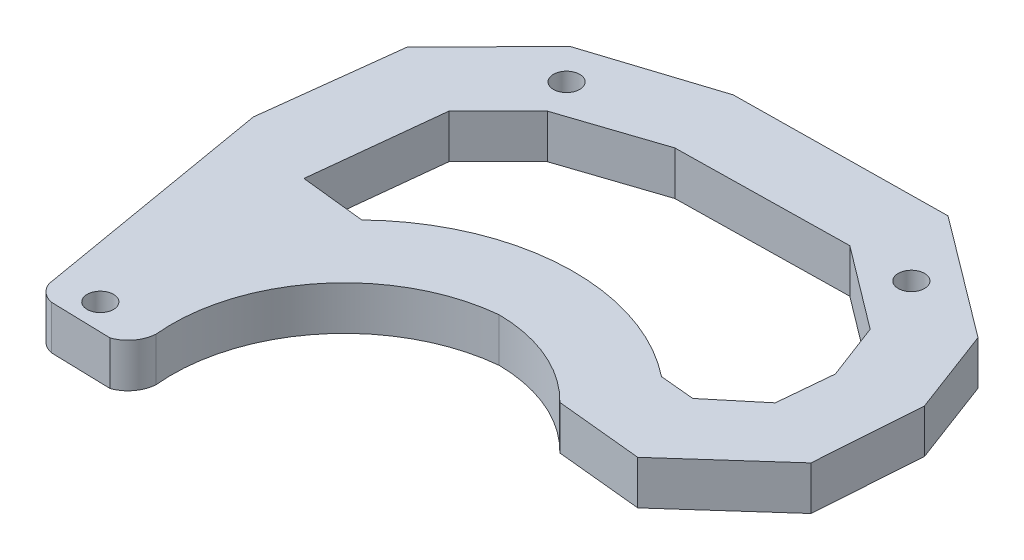
ISO-10303-21;
HEADER;
FILE_DESCRIPTION(('STEP AP214'),'2;1');
FILE_NAME('part.step','',(''),(''),'','','');
FILE_SCHEMA(('AUTOMOTIVE_DESIGN { 1 0 10303 214 1 1 1 1 }'));
ENDSEC;
DATA;
#1=APPLICATION_CONTEXT('core data for automotive mechanical design processes');
#2=APPLICATION_PROTOCOL_DEFINITION('international standard','automotive_design',2000,#1);
#3=PRODUCT_CONTEXT('',#1,'mechanical');
#4=PRODUCT('Part','Part','',(#3));
#5=PRODUCT_RELATED_PRODUCT_CATEGORY('part','',(#4));
#6=PRODUCT_DEFINITION_FORMATION('','',#4);
#7=PRODUCT_DEFINITION_CONTEXT('part definition',#1,'design');
#8=PRODUCT_DEFINITION('design','',#6,#7);
#9=PRODUCT_DEFINITION_SHAPE('','',#8);
#10=(LENGTH_UNIT() NAMED_UNIT(*) SI_UNIT(.MILLI.,.METRE.));
#11=(NAMED_UNIT(*) PLANE_ANGLE_UNIT() SI_UNIT($,.RADIAN.));
#12=(NAMED_UNIT(*) SI_UNIT($,.STERADIAN.) SOLID_ANGLE_UNIT());
#13=UNCERTAINTY_MEASURE_WITH_UNIT(LENGTH_MEASURE(1.E-05),#10,'distance_accuracy_value','');
#14=(GEOMETRIC_REPRESENTATION_CONTEXT(3) GLOBAL_UNCERTAINTY_ASSIGNED_CONTEXT((#13)) GLOBAL_UNIT_ASSIGNED_CONTEXT((#10,
#11,#12)) REPRESENTATION_CONTEXT('',''));
#15=CARTESIAN_POINT('',(0.,0.,0.));
#16=DIRECTION('',(0.,0.,1.));
#17=DIRECTION('',(1.,0.,0.));
#18=AXIS2_PLACEMENT_3D('',#15,#16,#17);
#19=CARTESIAN_POINT('',(23.8619489201939,5.,-4.36412708206895));
#20=DIRECTION('',(0.,-1.,0.));
#21=DIRECTION('',(0.,0.,-1.));
#22=AXIS2_PLACEMENT_3D('',#19,#20,#21);
#23=PLANE('',#22);
#24=CARTESIAN_POINT('',(0.,5.,0.));
#25=DIRECTION('',(0.,1.,0.));
#26=DIRECTION('',(0.,0.,1.));
#27=AXIS2_PLACEMENT_3D('',#24,#25,#26);
#28=CIRCLE('',#27,1.5);
#29=CARTESIAN_POINT('',(0.,5.,1.5));
#30=VERTEX_POINT('',#29);
#31=EDGE_CURVE('E489',#30,#30,#28,.T.);
#32=ORIENTED_EDGE('',*,*,#31,.F.);
#33=EDGE_LOOP('',(#32));
#34=FACE_BOUND('',#33,.T.);
#35=CARTESIAN_POINT('',(44.1944725973829,5.,-48.3351235325393));
#36=DIRECTION('',(0.,1.,0.));
#37=DIRECTION('',(0.,0.,1.));
#38=AXIS2_PLACEMENT_3D('',#35,#36,#37);
#39=CIRCLE('',#38,1.5);
#40=CARTESIAN_POINT('',(44.1944725973829,5.,-46.8351235325393));
#41=VERTEX_POINT('',#40);
#42=EDGE_CURVE('E935',#41,#41,#39,.T.);
#43=ORIENTED_EDGE('',*,*,#42,.F.);
#44=EDGE_LOOP('',(#43));
#45=FACE_BOUND('',#44,.T.);
#46=CARTESIAN_POINT('',(4.85938662458676,5.,-48.3351235325393));
#47=DIRECTION('',(0.,1.,0.));
#48=DIRECTION('',(0.,0.,1.));
#49=AXIS2_PLACEMENT_3D('',#46,#47,#48);
#50=CIRCLE('',#49,1.5);
#51=CARTESIAN_POINT('',(4.85938662458676,5.,-46.8351235325393));
#52=VERTEX_POINT('',#51);
#53=EDGE_CURVE('E937',#52,#52,#50,.T.);
#54=ORIENTED_EDGE('',*,*,#53,.F.);
#55=EDGE_LOOP('',(#54));
#56=FACE_BOUND('',#55,.T.);
#57=CARTESIAN_POINT('',(23.8619489201939,5.,-4.36412708206895));
#58=DIRECTION('',(0.,-1.,0.));
#59=DIRECTION('',(0.,0.,-1.));
#60=AXIS2_PLACEMENT_3D('',#57,#58,#59);
#61=CIRCLE('',#60,17.1176645684823);
#62=CARTESIAN_POINT('',(24.0303696505869,5.,-21.4809630845738));
#63=VERTEX_POINT('',#62);
#64=CARTESIAN_POINT('',(36.1485437948303,5.,-16.282769062833));
#65=VERTEX_POINT('',#64);
#66=EDGE_CURVE('E339',#63,#65,#61,.T.);
#67=ORIENTED_EDGE('',*,*,#66,.T.);
#68=DIRECTION('',(0.995092776882781,0.,0.0989462752998577));
#69=VECTOR('',#68,1.);
#70=CARTESIAN_POINT('',(36.1485437948303,5.,-16.282769062833));
#71=LINE('',#70,#69);
#72=CARTESIAN_POINT('',(46.0125685543336,5.,-15.3019474428874));
#73=VERTEX_POINT('',#72);
#74=EDGE_CURVE('E343',#65,#73,#71,.T.);
#75=ORIENTED_EDGE('',*,*,#74,.T.);
#76=DIRECTION('',(0.745619037206649,0.,-0.666372456930079));
#77=VECTOR('',#76,1.);
#78=CARTESIAN_POINT('',(46.0125685543336,5.,-15.3019474428874));
#79=LINE('',#78,#77);
#80=CARTESIAN_POINT('',(56.4485439017676,5.,-24.6287566922655));
#81=VERTEX_POINT('',#80);
#82=EDGE_CURVE('E347',#73,#81,#79,.T.);
#83=ORIENTED_EDGE('',*,*,#82,.T.);
#84=DIRECTION('',(0.0694048542160812,0.,-0.997588575621857));
#85=VECTOR('',#84,1.);
#86=CARTESIAN_POINT('',(56.4485439017676,5.,-24.6287566922655));
#87=LINE('',#86,#85);
#88=CARTESIAN_POINT('',(57.2910563095753,5.,-36.7385833368377));
#89=VERTEX_POINT('',#88);
#90=EDGE_CURVE('E350',#81,#89,#87,.T.);
#91=ORIENTED_EDGE('',*,*,#90,.T.);
#92=DIRECTION('',(-0.352627894261719,0.,-0.935763628374466));
#93=VECTOR('',#92,1.);
#94=CARTESIAN_POINT('',(53.5993779387816,5.,-46.5351377310327));
#95=LINE('',#94,#93);
#96=CARTESIAN_POINT('',(53.5993779387816,5.,-46.5351377310327));
#97=VERTEX_POINT('',#96);
#98=EDGE_CURVE('E353',#89,#97,#95,.T.);
#99=ORIENTED_EDGE('',*,*,#98,.T.);
#100=DIRECTION('',(-0.799549081819372,0.,-0.600600754046978));
#101=VECTOR('',#100,1.);
#102=CARTESIAN_POINT('',(39.8562210186548,5.,-56.8586445636987));
#103=LINE('',#102,#101);
#104=CARTESIAN_POINT('',(39.8562210186548,5.,-56.8586445636987));
#105=VERTEX_POINT('',#104);
#106=EDGE_CURVE('E356',#97,#105,#103,.T.);
#107=ORIENTED_EDGE('',*,*,#106,.T.);
#108=DIRECTION('',(-0.999923776978017,0.,0.0123466689441868));
#109=VECTOR('',#108,1.);
#110=CARTESIAN_POINT('',(15.6513017988494,5.,-56.5597716582749));
#111=LINE('',#110,#109);
#112=CARTESIAN_POINT('',(15.6513017988494,5.,-56.5597716582749));
#113=VERTEX_POINT('',#112);
#114=EDGE_CURVE('E359',#105,#113,#111,.T.);
#115=ORIENTED_EDGE('',*,*,#114,.T.);
#116=DIRECTION('',(-0.952162057756407,0.,0.305593546674476));
#117=VECTOR('',#116,1.);
#118=CARTESIAN_POINT('',(1.56972804240098,5.,-52.0403329430513));
#119=LINE('',#118,#117);
#120=CARTESIAN_POINT('',(1.56972804240098,5.,-52.0403329430513));
#121=VERTEX_POINT('',#120);
#122=EDGE_CURVE('E362',#113,#121,#119,.T.);
#123=ORIENTED_EDGE('',*,*,#122,.T.);
#124=DIRECTION('',(-0.702611164135424,0.,0.711573996174863));
#125=VECTOR('',#124,1.);
#126=CARTESIAN_POINT('',(-7.66832590474408,5.,-42.6844341193572));
#127=LINE('',#126,#125);
#128=CARTESIAN_POINT('',(-7.66832590474408,5.,-42.6844341193572));
#129=VERTEX_POINT('',#128);
#130=EDGE_CURVE('E365',#121,#129,#127,.T.);
#131=ORIENTED_EDGE('',*,*,#130,.T.);
#132=DIRECTION('',(-0.118846884238914,0.,0.992912593387103));
#133=VECTOR('',#132,1.);
#134=CARTESIAN_POINT('',(-9.54463394847041,5.,-27.0087191216949));
#135=LINE('',#134,#133);
#136=CARTESIAN_POINT('',(-9.54463394847041,5.,-27.0087191216949));
#137=VERTEX_POINT('',#136);
#138=EDGE_CURVE('E368',#129,#137,#135,.T.);
#139=ORIENTED_EDGE('',*,*,#138,.T.);
#140=DIRECTION('',(0.168776467263028,0.,0.985654353258896));
#141=VECTOR('',#140,1.);
#142=CARTESIAN_POINT('',(-9.54463394847041,5.,-27.0087191216949));
#143=LINE('',#142,#141);
#144=CARTESIAN_POINT('',(-4.73336120879583,5.,1.08910753316435));
#145=VERTEX_POINT('',#144);
#146=EDGE_CURVE('E371',#137,#145,#143,.T.);
#147=ORIENTED_EDGE('',*,*,#146,.T.);
#148=CARTESIAN_POINT('',(-2.2064226973066,5.,0.202619342875816));
#149=DIRECTION('',(0.,1.,0.));
#150=DIRECTION('',(0.,0.,1.));
#151=AXIS2_PLACEMENT_3D('',#148,#149,#150);
#152=CIRCLE('',#151,2.67792448593467);
#153=CARTESIAN_POINT('',(-2.77137388857478,5.,2.82027281571234));
#154=VERTEX_POINT('',#153);
#155=EDGE_CURVE('E374',#145,#154,#152,.T.);
#156=ORIENTED_EDGE('',*,*,#155,.T.);
#157=DIRECTION('',(0.999639850526293,0.,0.0268359691416453));
#158=VECTOR('',#157,1.);
#159=CARTESIAN_POINT('',(-2.77137388857478,5.,2.82027281571234));
#160=LINE('',#159,#158);
#161=CARTESIAN_POINT('',(4.10712283408258,5.,3.0049304458508));
#162=VERTEX_POINT('',#161);
#163=EDGE_CURVE('E377',#154,#162,#160,.T.);
#164=ORIENTED_EDGE('',*,*,#163,.T.);
#165=CARTESIAN_POINT('',(2.97809004025998,5.,-0.193420609139489));
#166=DIRECTION('',(0.,1.,0.));
#167=DIRECTION('',(0.,0.,1.));
#168=AXIS2_PLACEMENT_3D('',#165,#166,#167);
#169=CIRCLE('',#168,3.39177896102979);
#170=CARTESIAN_POINT('',(6.36434947929362,5.,0.));
#171=VERTEX_POINT('',#170);
#172=EDGE_CURVE('E380',#162,#171,#169,.T.);
#173=ORIENTED_EDGE('',*,*,#172,.T.);
#174=CARTESIAN_POINT('',(25.9378411072272,5.,-1.90747145664024));
#175=DIRECTION('',(0.,-1.,0.));
#176=DIRECTION('',(0.,0.,-1.));
#177=AXIS2_PLACEMENT_3D('',#174,#175,#176);
#178=CIRCLE('',#177,19.6662152400172);
#179=EDGE_CURVE('E383',#171,#63,#178,.T.);
#180=ORIENTED_EDGE('',*,*,#179,.T.);
#181=EDGE_LOOP('',(#67,#75,#83,#91,#99,#107,#115,#123,#131,#139,#147,#156,#164,#173,#180));
#182=FACE_BOUND('',#181,.T.);
#183=DIRECTION('',(-0.707106781186546,0.,0.707106781186549));
#184=VECTOR('',#183,1.);
#185=CARTESIAN_POINT('',(1.03693216322498,5.,-38.7436949319863));
#186=LINE('',#185,#184);
#187=CARTESIAN_POINT('',(6.64236036606208,5.,-44.3491231348234));
#188=VERTEX_POINT('',#187);
#189=CARTESIAN_POINT('',(1.03693216322498,5.,-38.7436949319863));
#190=VERTEX_POINT('',#189);
#191=EDGE_CURVE('E219',#188,#190,#186,.T.);
#192=ORIENTED_EDGE('',*,*,#191,.F.);
#193=DIRECTION('',(-0.948731193483916,0.,0.31608404342925));
#194=VECTOR('',#193,1.);
#195=CARTESIAN_POINT('',(6.64236036606208,5.,-44.3491231348234));
#196=LINE('',#195,#194);
#197=CARTESIAN_POINT('',(17.5559797368616,5.,-47.9851593090979));
#198=VERTEX_POINT('',#197);
#199=EDGE_CURVE('E270',#198,#188,#196,.T.);
#200=ORIENTED_EDGE('',*,*,#199,.F.);
#201=DIRECTION('',(-0.999861079104886,0.,0.01666800801576));
#202=VECTOR('',#201,1.);
#203=CARTESIAN_POINT('',(17.5559797368616,5.,-47.9851593090979));
#204=LINE('',#203,#202);
#205=CARTESIAN_POINT('',(37.1977068824665,5.,-48.312593262022));
#206=VERTEX_POINT('',#205);
#207=EDGE_CURVE('E267',#206,#198,#204,.T.);
#208=ORIENTED_EDGE('',*,*,#207,.F.);
#209=DIRECTION('',(-0.798629426543705,0.,-0.601823096149087));
#210=VECTOR('',#209,1.);
#211=CARTESIAN_POINT('',(37.1977068824665,5.,-48.312593262022));
#212=LINE('',#211,#210);
#213=CARTESIAN_POINT('',(46.6193574297928,5.,-41.2127210124282));
#214=VERTEX_POINT('',#213);
#215=EDGE_CURVE('E264',#214,#206,#212,.T.);
#216=ORIENTED_EDGE('',*,*,#215,.F.);
#217=DIRECTION('',(-0.355533832782758,0.,-0.934663412008196));
#218=VECTOR('',#217,1.);
#219=CARTESIAN_POINT('',(46.6193574297928,5.,-41.2127210124282));
#220=LINE('',#219,#218);
#221=CARTESIAN_POINT('',(49.0568617814096,5.,-34.8047622642122));
#222=VERTEX_POINT('',#221);
#223=EDGE_CURVE('E261',#222,#214,#220,.T.);
#224=ORIENTED_EDGE('',*,*,#223,.F.);
#225=DIRECTION('',(0.092073061092457,0.,-0.995752254037652));
#226=VECTOR('',#225,1.);
#227=CARTESIAN_POINT('',(49.0568617814096,5.,-34.8047622642122));
#228=LINE('',#227,#226);
#229=CARTESIAN_POINT('',(48.476214586387,5.,-28.5251757447219));
#230=VERTEX_POINT('',#229);
#231=EDGE_CURVE('E258',#230,#222,#228,.T.);
#232=ORIENTED_EDGE('',*,*,#231,.F.);
#233=DIRECTION('',(0.769208657074878,0.,-0.638997685348752));
#234=VECTOR('',#233,1.);
#235=CARTESIAN_POINT('',(48.476214586387,5.,-28.5251757447219));
#236=LINE('',#235,#234);
#237=CARTESIAN_POINT('',(43.3401157324975,5.,-24.2585112328607));
#238=VERTEX_POINT('',#237);
#239=EDGE_CURVE('E255',#238,#230,#236,.T.);
#240=ORIENTED_EDGE('',*,*,#239,.F.);
#241=DIRECTION('',(0.995623727114849,0.,0.0934526297432885));
#242=VECTOR('',#241,1.);
#243=CARTESIAN_POINT('',(39.3956021831996,5.,-24.6287566922655));
#244=LINE('',#243,#242);
#245=CARTESIAN_POINT('',(39.3956021831996,5.,-24.6287566922655));
#246=VERTEX_POINT('',#245);
#247=EDGE_CURVE('E252',#246,#238,#244,.T.);
#248=ORIENTED_EDGE('',*,*,#247,.F.);
#249=CARTESIAN_POINT('',(24.0303696505866,5.,-5.29538032178516));
#250=DIRECTION('',(0.,-1.,0.));
#251=DIRECTION('',(0.,0.,-1.));
#252=AXIS2_PLACEMENT_3D('',#249,#250,#251);
#253=CIRCLE('',#252,24.6955423642388);
#254=CARTESIAN_POINT('',(6.82438908619323,5.,-23.010459928765));
#255=VERTEX_POINT('',#254);
#256=EDGE_CURVE('E246',#255,#246,#253,.T.);
#257=ORIENTED_EDGE('',*,*,#256,.F.);
#258=DIRECTION('',(0.994198791361643,0.,0.107558185439546));
#259=VECTOR('',#258,1.);
#260=CARTESIAN_POINT('',(-0.578535298914211,5.,-23.8113511798173));
#261=LINE('',#260,#259);
#262=CARTESIAN_POINT('',(-0.578535298914211,5.,-23.8113511798173));
#263=VERTEX_POINT('',#262);
#264=EDGE_CURVE('E242',#263,#255,#261,.T.);
#265=ORIENTED_EDGE('',*,*,#264,.F.);
#266=DIRECTION('',(-0.107558185439546,0.,0.994198791361643));
#267=VECTOR('',#266,1.);
#268=CARTESIAN_POINT('',(1.03693216322498,5.,-38.7436949319863));
#269=LINE('',#268,#267);
#270=EDGE_CURVE('E228',#190,#263,#269,.T.);
#271=ORIENTED_EDGE('',*,*,#270,.F.);
#272=EDGE_LOOP('',(#192,#200,#208,#216,#224,#232,#240,#248,#257,#265,#271));
#273=FACE_BOUND('',#272,.T.);
#274=ADVANCED_FACE('F43',(#34,#45,#56,#182,#273),#23,.F.);
#275=CARTESIAN_POINT('',(23.8619489201939,0.,-4.36412708206895));
#276=DIRECTION('',(0.,-1.,0.));
#277=DIRECTION('',(0.,0.,-1.));
#278=AXIS2_PLACEMENT_3D('',#275,#276,#277);
#279=PLANE('',#278);
#280=CARTESIAN_POINT('',(0.,0.,0.));
#281=DIRECTION('',(0.,-1.,0.));
#282=DIRECTION('',(0.,0.,-1.));
#283=AXIS2_PLACEMENT_3D('',#280,#281,#282);
#284=CIRCLE('',#283,1.5);
#285=CARTESIAN_POINT('',(0.,0.,-1.5));
#286=VERTEX_POINT('',#285);
#287=EDGE_CURVE('E47',#286,#286,#284,.T.);
#288=ORIENTED_EDGE('',*,*,#287,.F.);
#289=EDGE_LOOP('',(#288));
#290=FACE_BOUND('',#289,.T.);
#291=CARTESIAN_POINT('',(44.1944725973829,0.,-48.3351235325393));
#292=DIRECTION('',(0.,-1.,0.));
#293=DIRECTION('',(0.,0.,-1.));
#294=AXIS2_PLACEMENT_3D('',#291,#292,#293);
#295=CIRCLE('',#294,1.5);
#296=CARTESIAN_POINT('',(44.1944725973829,0.,-49.8351235325393));
#297=VERTEX_POINT('',#296);
#298=EDGE_CURVE('E488',#297,#297,#295,.T.);
#299=ORIENTED_EDGE('',*,*,#298,.F.);
#300=EDGE_LOOP('',(#299));
#301=FACE_BOUND('',#300,.T.);
#302=CARTESIAN_POINT('',(4.85938662458676,0.,-48.3351235325393));
#303=DIRECTION('',(0.,-1.,0.));
#304=DIRECTION('',(0.,0.,-1.));
#305=AXIS2_PLACEMENT_3D('',#302,#303,#304);
#306=CIRCLE('',#305,1.5);
#307=CARTESIAN_POINT('',(4.85938662458676,0.,-49.8351235325393));
#308=VERTEX_POINT('',#307);
#309=EDGE_CURVE('E485',#308,#308,#306,.T.);
#310=ORIENTED_EDGE('',*,*,#309,.F.);
#311=EDGE_LOOP('',(#310));
#312=FACE_BOUND('',#311,.T.);
#313=CARTESIAN_POINT('',(23.8619489201939,0.,-4.36412708206895));
#314=DIRECTION('',(0.,-1.,0.));
#315=DIRECTION('',(0.,0.,-1.));
#316=AXIS2_PLACEMENT_3D('',#313,#314,#315);
#317=CIRCLE('',#316,17.1176645684823);
#318=CARTESIAN_POINT('',(24.0303696505869,0.,-21.4809630845738));
#319=VERTEX_POINT('',#318);
#320=CARTESIAN_POINT('',(36.1485437948303,0.,-16.282769062833));
#321=VERTEX_POINT('',#320);
#322=EDGE_CURVE('E237',#319,#321,#317,.T.);
#323=ORIENTED_EDGE('',*,*,#322,.F.);
#324=CARTESIAN_POINT('',(25.9378411072272,0.,-1.90747145664024));
#325=DIRECTION('',(0.,-1.,0.));
#326=DIRECTION('',(0.,0.,-1.));
#327=AXIS2_PLACEMENT_3D('',#324,#325,#326);
#328=CIRCLE('',#327,19.6662152400172);
#329=CARTESIAN_POINT('',(6.36434947929362,0.,0.));
#330=VERTEX_POINT('',#329);
#331=EDGE_CURVE('E344',#330,#319,#328,.T.);
#332=ORIENTED_EDGE('',*,*,#331,.F.);
#333=CARTESIAN_POINT('',(2.97809004025998,0.,-0.193420609139489));
#334=DIRECTION('',(0.,1.,0.));
#335=DIRECTION('',(0.,0.,1.));
#336=AXIS2_PLACEMENT_3D('',#333,#334,#335);
#337=CIRCLE('',#336,3.39177896102979);
#338=CARTESIAN_POINT('',(4.10712283408258,0.,3.0049304458508));
#339=VERTEX_POINT('',#338);
#340=EDGE_CURVE('E426',#339,#330,#337,.T.);
#341=ORIENTED_EDGE('',*,*,#340,.F.);
#342=DIRECTION('',(0.999639850526293,0.,0.0268359691416453));
#343=VECTOR('',#342,1.);
#344=CARTESIAN_POINT('',(-2.77137388857478,0.,2.82027281571234));
#345=LINE('',#344,#343);
#346=CARTESIAN_POINT('',(-2.77137388857478,0.,2.82027281571234));
#347=VERTEX_POINT('',#346);
#348=EDGE_CURVE('E423',#347,#339,#345,.T.);
#349=ORIENTED_EDGE('',*,*,#348,.F.);
#350=CARTESIAN_POINT('',(-2.2064226973066,0.,0.202619342875816));
#351=DIRECTION('',(0.,1.,0.));
#352=DIRECTION('',(0.,0.,1.));
#353=AXIS2_PLACEMENT_3D('',#350,#351,#352);
#354=CIRCLE('',#353,2.67792448593467);
#355=CARTESIAN_POINT('',(-4.73336120879583,0.,1.08910753316435));
#356=VERTEX_POINT('',#355);
#357=EDGE_CURVE('E420',#356,#347,#354,.T.);
#358=ORIENTED_EDGE('',*,*,#357,.F.);
#359=DIRECTION('',(0.168776467263028,0.,0.985654353258896));
#360=VECTOR('',#359,1.);
#361=CARTESIAN_POINT('',(-9.54463394847041,0.,-27.0087191216949));
#362=LINE('',#361,#360);
#363=CARTESIAN_POINT('',(-9.54463394847041,0.,-27.0087191216949));
#364=VERTEX_POINT('',#363);
#365=EDGE_CURVE('E417',#364,#356,#362,.T.);
#366=ORIENTED_EDGE('',*,*,#365,.F.);
#367=DIRECTION('',(-0.118846884238914,0.,0.992912593387103));
#368=VECTOR('',#367,1.);
#369=CARTESIAN_POINT('',(-9.54463394847041,0.,-27.0087191216949));
#370=LINE('',#369,#368);
#371=CARTESIAN_POINT('',(-7.66832590474408,0.,-42.6844341193572));
#372=VERTEX_POINT('',#371);
#373=EDGE_CURVE('E414',#372,#364,#370,.T.);
#374=ORIENTED_EDGE('',*,*,#373,.F.);
#375=DIRECTION('',(-0.702611164135424,0.,0.711573996174863));
#376=VECTOR('',#375,1.);
#377=CARTESIAN_POINT('',(-7.66832590474408,0.,-42.6844341193572));
#378=LINE('',#377,#376);
#379=CARTESIAN_POINT('',(1.56972804240098,0.,-52.0403329430513));
#380=VERTEX_POINT('',#379);
#381=EDGE_CURVE('E411',#380,#372,#378,.T.);
#382=ORIENTED_EDGE('',*,*,#381,.F.);
#383=DIRECTION('',(-0.952162057756407,0.,0.305593546674476));
#384=VECTOR('',#383,1.);
#385=CARTESIAN_POINT('',(1.56972804240098,0.,-52.0403329430513));
#386=LINE('',#385,#384);
#387=CARTESIAN_POINT('',(15.6513017988494,0.,-56.5597716582749));
#388=VERTEX_POINT('',#387);
#389=EDGE_CURVE('E408',#388,#380,#386,.T.);
#390=ORIENTED_EDGE('',*,*,#389,.F.);
#391=DIRECTION('',(-0.999923776978017,0.,0.0123466689441868));
#392=VECTOR('',#391,1.);
#393=CARTESIAN_POINT('',(15.6513017988494,0.,-56.5597716582749));
#394=LINE('',#393,#392);
#395=CARTESIAN_POINT('',(39.8562210186548,0.,-56.8586445636987));
#396=VERTEX_POINT('',#395);
#397=EDGE_CURVE('E405',#396,#388,#394,.T.);
#398=ORIENTED_EDGE('',*,*,#397,.F.);
#399=DIRECTION('',(-0.799549081819372,0.,-0.600600754046978));
#400=VECTOR('',#399,1.);
#401=CARTESIAN_POINT('',(39.8562210186548,0.,-56.8586445636987));
#402=LINE('',#401,#400);
#403=CARTESIAN_POINT('',(53.5993779387816,0.,-46.5351377310327));
#404=VERTEX_POINT('',#403);
#405=EDGE_CURVE('E402',#404,#396,#402,.T.);
#406=ORIENTED_EDGE('',*,*,#405,.F.);
#407=DIRECTION('',(-0.352627894261719,0.,-0.935763628374466));
#408=VECTOR('',#407,1.);
#409=CARTESIAN_POINT('',(53.5993779387816,0.,-46.5351377310327));
#410=LINE('',#409,#408);
#411=CARTESIAN_POINT('',(57.2910563095753,0.,-36.7385833368377));
#412=VERTEX_POINT('',#411);
#413=EDGE_CURVE('E399',#412,#404,#410,.T.);
#414=ORIENTED_EDGE('',*,*,#413,.F.);
#415=DIRECTION('',(0.0694048542160812,0.,-0.997588575621857));
#416=VECTOR('',#415,1.);
#417=CARTESIAN_POINT('',(56.4485439017676,0.,-24.6287566922655));
#418=LINE('',#417,#416);
#419=CARTESIAN_POINT('',(56.4485439017676,0.,-24.6287566922655));
#420=VERTEX_POINT('',#419);
#421=EDGE_CURVE('E396',#420,#412,#418,.T.);
#422=ORIENTED_EDGE('',*,*,#421,.F.);
#423=DIRECTION('',(0.745619037206649,0.,-0.666372456930079));
#424=VECTOR('',#423,1.);
#425=CARTESIAN_POINT('',(46.0125685543336,0.,-15.3019474428874));
#426=LINE('',#425,#424);
#427=CARTESIAN_POINT('',(46.0125685543336,0.,-15.3019474428874));
#428=VERTEX_POINT('',#427);
#429=EDGE_CURVE('E393',#428,#420,#426,.T.);
#430=ORIENTED_EDGE('',*,*,#429,.F.);
#431=DIRECTION('',(0.995092776882781,0.,0.0989462752998577));
#432=VECTOR('',#431,1.);
#433=CARTESIAN_POINT('',(36.1485437948303,0.,-16.282769062833));
#434=LINE('',#433,#432);
#435=EDGE_CURVE('E390',#321,#428,#434,.T.);
#436=ORIENTED_EDGE('',*,*,#435,.F.);
#437=EDGE_LOOP('',(#323,#332,#341,#349,#358,#366,#374,#382,#390,#398,#406,#414,#422,#430,#436));
#438=FACE_BOUND('',#437,.T.);
#439=DIRECTION('',(-0.948731193483916,0.,0.31608404342925));
#440=VECTOR('',#439,1.);
#441=CARTESIAN_POINT('',(6.64236036606208,0.,-44.3491231348234));
#442=LINE('',#441,#440);
#443=CARTESIAN_POINT('',(17.5559797368616,0.,-47.9851593090979));
#444=VERTEX_POINT('',#443);
#445=CARTESIAN_POINT('',(6.64236036606208,0.,-44.3491231348234));
#446=VERTEX_POINT('',#445);
#447=EDGE_CURVE('E229',#444,#446,#442,.T.);
#448=ORIENTED_EDGE('',*,*,#447,.T.);
#449=DIRECTION('',(-0.707106781186546,0.,0.707106781186549));
#450=VECTOR('',#449,1.);
#451=CARTESIAN_POINT('',(1.03693216322498,0.,-38.7436949319863));
#452=LINE('',#451,#450);
#453=CARTESIAN_POINT('',(1.03693216322498,0.,-38.7436949319863));
#454=VERTEX_POINT('',#453);
#455=EDGE_CURVE('E69',#446,#454,#452,.T.);
#456=ORIENTED_EDGE('',*,*,#455,.T.);
#457=DIRECTION('',(-0.107558185439546,0.,0.994198791361643));
#458=VECTOR('',#457,1.);
#459=CARTESIAN_POINT('',(1.03693216322498,0.,-38.7436949319863));
#460=LINE('',#459,#458);
#461=CARTESIAN_POINT('',(-0.578535298914211,0.,-23.8113511798173));
#462=VERTEX_POINT('',#461);
#463=EDGE_CURVE('E235',#454,#462,#460,.T.);
#464=ORIENTED_EDGE('',*,*,#463,.T.);
#465=DIRECTION('',(0.994198791361643,0.,0.107558185439546));
#466=VECTOR('',#465,1.);
#467=CARTESIAN_POINT('',(-0.578535298914211,0.,-23.8113511798173));
#468=LINE('',#467,#466);
#469=CARTESIAN_POINT('',(6.82438908619323,0.,-23.010459928765));
#470=VERTEX_POINT('',#469);
#471=EDGE_CURVE('E277',#462,#470,#468,.T.);
#472=ORIENTED_EDGE('',*,*,#471,.T.);
#473=CARTESIAN_POINT('',(24.0303696505866,0.,-5.29538032178516));
#474=DIRECTION('',(0.,-1.,0.));
#475=DIRECTION('',(0.,0.,-1.));
#476=AXIS2_PLACEMENT_3D('',#473,#474,#475);
#477=CIRCLE('',#476,24.6955423642388);
#478=CARTESIAN_POINT('',(39.3956021831996,0.,-24.6287566922655));
#479=VERTEX_POINT('',#478);
#480=EDGE_CURVE('E281',#470,#479,#477,.T.);
#481=ORIENTED_EDGE('',*,*,#480,.T.);
#482=DIRECTION('',(0.995623727114849,0.,0.0934526297432885));
#483=VECTOR('',#482,1.);
#484=CARTESIAN_POINT('',(39.3956021831996,0.,-24.6287566922655));
#485=LINE('',#484,#483);
#486=CARTESIAN_POINT('',(43.3401157324975,0.,-24.2585112328607));
#487=VERTEX_POINT('',#486);
#488=EDGE_CURVE('E285',#479,#487,#485,.T.);
#489=ORIENTED_EDGE('',*,*,#488,.T.);
#490=DIRECTION('',(0.769208657074878,0.,-0.638997685348752));
#491=VECTOR('',#490,1.);
#492=CARTESIAN_POINT('',(48.476214586387,0.,-28.5251757447219));
#493=LINE('',#492,#491);
#494=CARTESIAN_POINT('',(48.476214586387,0.,-28.5251757447219));
#495=VERTEX_POINT('',#494);
#496=EDGE_CURVE('E289',#487,#495,#493,.T.);
#497=ORIENTED_EDGE('',*,*,#496,.T.);
#498=DIRECTION('',(0.092073061092457,0.,-0.995752254037652));
#499=VECTOR('',#498,1.);
#500=CARTESIAN_POINT('',(49.0568617814096,0.,-34.8047622642122));
#501=LINE('',#500,#499);
#502=CARTESIAN_POINT('',(49.0568617814096,0.,-34.8047622642122));
#503=VERTEX_POINT('',#502);
#504=EDGE_CURVE('E293',#495,#503,#501,.T.);
#505=ORIENTED_EDGE('',*,*,#504,.T.);
#506=DIRECTION('',(-0.355533832782758,0.,-0.934663412008196));
#507=VECTOR('',#506,1.);
#508=CARTESIAN_POINT('',(46.6193574297928,0.,-41.2127210124282));
#509=LINE('',#508,#507);
#510=CARTESIAN_POINT('',(46.6193574297928,0.,-41.2127210124282));
#511=VERTEX_POINT('',#510);
#512=EDGE_CURVE('E297',#503,#511,#509,.T.);
#513=ORIENTED_EDGE('',*,*,#512,.T.);
#514=DIRECTION('',(-0.798629426543705,0.,-0.601823096149087));
#515=VECTOR('',#514,1.);
#516=CARTESIAN_POINT('',(37.1977068824665,0.,-48.312593262022));
#517=LINE('',#516,#515);
#518=CARTESIAN_POINT('',(37.1977068824665,0.,-48.312593262022));
#519=VERTEX_POINT('',#518);
#520=EDGE_CURVE('E301',#511,#519,#517,.T.);
#521=ORIENTED_EDGE('',*,*,#520,.T.);
#522=DIRECTION('',(-0.999861079104886,0.,0.01666800801576));
#523=VECTOR('',#522,1.);
#524=CARTESIAN_POINT('',(17.5559797368616,0.,-47.9851593090979));
#525=LINE('',#524,#523);
#526=EDGE_CURVE('E305',#519,#444,#525,.T.);
#527=ORIENTED_EDGE('',*,*,#526,.T.);
#528=EDGE_LOOP('',(#448,#456,#464,#472,#481,#489,#497,#505,#513,#521,#527));
#529=FACE_BOUND('',#528,.T.);
#530=ADVANCED_FACE('F501',(#290,#301,#312,#438,#529),#279,.T.);
#531=CARTESIAN_POINT('',(23.8619489201939,5.,-4.36412708206895));
#532=DIRECTION('',(0.,-1.,0.));
#533=DIRECTION('',(0.,0.,-1.));
#534=AXIS2_PLACEMENT_3D('',#531,#532,#533);
#535=CYLINDRICAL_SURFACE('',#534,17.1176645684823);
#536=ORIENTED_EDGE('',*,*,#322,.T.);
#537=DIRECTION('',(0.,-1.,0.));
#538=VECTOR('',#537,1.);
#539=CARTESIAN_POINT('',(36.1485437948303,5.,-16.282769062833));
#540=LINE('',#539,#538);
#541=EDGE_CURVE('E11',#65,#321,#540,.T.);
#542=ORIENTED_EDGE('',*,*,#541,.F.);
#543=ORIENTED_EDGE('',*,*,#66,.F.);
#544=DIRECTION('',(0.,-1.,0.));
#545=VECTOR('',#544,1.);
#546=CARTESIAN_POINT('',(24.0303696505869,5.,-21.4809630845738));
#547=LINE('',#546,#545);
#548=EDGE_CURVE('E386',#63,#319,#547,.T.);
#549=ORIENTED_EDGE('',*,*,#548,.T.);
#550=EDGE_LOOP('',(#536,#542,#543,#549));
#551=FACE_BOUND('',#550,.T.);
#552=ADVANCED_FACE('F45',(#551),#535,.F.);
#553=CARTESIAN_POINT('',(36.1485437948303,5.,-16.282769062833));
#554=DIRECTION('',(0.0989462752998578,0.,-0.995092776882781));
#555=DIRECTION('',(-0.995092776882781,0.,-0.0989462752998578));
#556=AXIS2_PLACEMENT_3D('',#553,#554,#555);
#557=PLANE('',#556);
#558=ORIENTED_EDGE('',*,*,#435,.T.);
#559=DIRECTION('',(0.,-1.,0.));
#560=VECTOR('',#559,1.);
#561=CARTESIAN_POINT('',(46.0125685543336,5.,-15.3019474428874));
#562=LINE('',#561,#560);
#563=EDGE_CURVE('E53',#73,#428,#562,.T.);
#564=ORIENTED_EDGE('',*,*,#563,.F.);
#565=ORIENTED_EDGE('',*,*,#74,.F.);
#566=ORIENTED_EDGE('',*,*,#541,.T.);
#567=EDGE_LOOP('',(#558,#564,#565,#566));
#568=FACE_BOUND('',#567,.T.);
#569=ADVANCED_FACE('F616',(#568),#557,.F.);
#570=CARTESIAN_POINT('',(46.0125685543336,5.,-15.3019474428874));
#571=DIRECTION('',(-0.666372456930079,0.,-0.745619037206649));
#572=DIRECTION('',(-0.745619037206649,0.,0.666372456930079));
#573=AXIS2_PLACEMENT_3D('',#570,#571,#572);
#574=PLANE('',#573);
#575=ORIENTED_EDGE('',*,*,#429,.T.);
#576=DIRECTION('',(0.,-1.,0.));
#577=VECTOR('',#576,1.);
#578=CARTESIAN_POINT('',(56.4485439017676,5.,-24.6287566922655));
#579=LINE('',#578,#577);
#580=EDGE_CURVE('E478',#81,#420,#579,.T.);
#581=ORIENTED_EDGE('',*,*,#580,.F.);
#582=ORIENTED_EDGE('',*,*,#82,.F.);
#583=ORIENTED_EDGE('',*,*,#563,.T.);
#584=EDGE_LOOP('',(#575,#581,#582,#583));
#585=FACE_BOUND('',#584,.T.);
#586=ADVANCED_FACE('F613',(#585),#574,.F.);
#587=CARTESIAN_POINT('',(56.4485439017676,5.,-24.6287566922655));
#588=DIRECTION('',(-0.997588575621857,0.,-0.0694048542160812));
#589=DIRECTION('',(-0.0694048542160812,0.,0.997588575621857));
#590=AXIS2_PLACEMENT_3D('',#587,#588,#589);
#591=PLANE('',#590);
#592=ORIENTED_EDGE('',*,*,#421,.T.);
#593=DIRECTION('',(0.,-1.,0.));
#594=VECTOR('',#593,1.);
#595=CARTESIAN_POINT('',(57.2910563095753,5.,-36.7385833368377));
#596=LINE('',#595,#594);
#597=EDGE_CURVE('E474',#89,#412,#596,.T.);
#598=ORIENTED_EDGE('',*,*,#597,.F.);
#599=ORIENTED_EDGE('',*,*,#90,.F.);
#600=ORIENTED_EDGE('',*,*,#580,.T.);
#601=EDGE_LOOP('',(#592,#598,#599,#600));
#602=FACE_BOUND('',#601,.T.);
#603=ADVANCED_FACE('F609',(#602),#591,.F.);
#604=CARTESIAN_POINT('',(53.5993779387816,5.,-46.5351377310327));
#605=DIRECTION('',(-0.935763628374466,0.,0.352627894261719));
#606=DIRECTION('',(0.352627894261719,0.,0.935763628374466));
#607=AXIS2_PLACEMENT_3D('',#604,#605,#606);
#608=PLANE('',#607);
#609=ORIENTED_EDGE('',*,*,#413,.T.);
#610=DIRECTION('',(0.,-1.,0.));
#611=VECTOR('',#610,1.);
#612=CARTESIAN_POINT('',(53.5993779387816,5.,-46.5351377310327));
#613=LINE('',#612,#611);
#614=EDGE_CURVE('E470',#97,#404,#613,.T.);
#615=ORIENTED_EDGE('',*,*,#614,.F.);
#616=ORIENTED_EDGE('',*,*,#98,.F.);
#617=ORIENTED_EDGE('',*,*,#597,.T.);
#618=EDGE_LOOP('',(#609,#615,#616,#617));
#619=FACE_BOUND('',#618,.T.);
#620=ADVANCED_FACE('F605',(#619),#608,.F.);
#621=CARTESIAN_POINT('',(39.8562210186548,5.,-56.8586445636987));
#622=DIRECTION('',(-0.600600754046978,0.,0.799549081819372));
#623=DIRECTION('',(0.799549081819372,0.,0.600600754046978));
#624=AXIS2_PLACEMENT_3D('',#621,#622,#623);
#625=PLANE('',#624);
#626=ORIENTED_EDGE('',*,*,#405,.T.);
#627=DIRECTION('',(0.,-1.,0.));
#628=VECTOR('',#627,1.);
#629=CARTESIAN_POINT('',(39.8562210186548,5.,-56.8586445636987));
#630=LINE('',#629,#628);
#631=EDGE_CURVE('E466',#105,#396,#630,.T.);
#632=ORIENTED_EDGE('',*,*,#631,.F.);
#633=ORIENTED_EDGE('',*,*,#106,.F.);
#634=ORIENTED_EDGE('',*,*,#614,.T.);
#635=EDGE_LOOP('',(#626,#632,#633,#634));
#636=FACE_BOUND('',#635,.T.);
#637=ADVANCED_FACE('F601',(#636),#625,.F.);
#638=CARTESIAN_POINT('',(15.6513017988494,5.,-56.5597716582749));
#639=DIRECTION('',(0.0123466689441868,0.,0.999923776978017));
#640=DIRECTION('',(0.999923776978017,0.,-0.0123466689441868));
#641=AXIS2_PLACEMENT_3D('',#638,#639,#640);
#642=PLANE('',#641);
#643=ORIENTED_EDGE('',*,*,#397,.T.);
#644=DIRECTION('',(0.,-1.,0.));
#645=VECTOR('',#644,1.);
#646=CARTESIAN_POINT('',(15.6513017988494,5.,-56.5597716582749));
#647=LINE('',#646,#645);
#648=EDGE_CURVE('E462',#113,#388,#647,.T.);
#649=ORIENTED_EDGE('',*,*,#648,.F.);
#650=ORIENTED_EDGE('',*,*,#114,.F.);
#651=ORIENTED_EDGE('',*,*,#631,.T.);
#652=EDGE_LOOP('',(#643,#649,#650,#651));
#653=FACE_BOUND('',#652,.T.);
#654=ADVANCED_FACE('F597',(#653),#642,.F.);
#655=CARTESIAN_POINT('',(1.56972804240098,5.,-52.0403329430513));
#656=DIRECTION('',(0.305593546674476,0.,0.952162057756407));
#657=DIRECTION('',(0.952162057756407,0.,-0.305593546674476));
#658=AXIS2_PLACEMENT_3D('',#655,#656,#657);
#659=PLANE('',#658);
#660=ORIENTED_EDGE('',*,*,#389,.T.);
#661=DIRECTION('',(0.,-1.,0.));
#662=VECTOR('',#661,1.);
#663=CARTESIAN_POINT('',(1.56972804240098,5.,-52.0403329430513));
#664=LINE('',#663,#662);
#665=EDGE_CURVE('E458',#121,#380,#664,.T.);
#666=ORIENTED_EDGE('',*,*,#665,.F.);
#667=ORIENTED_EDGE('',*,*,#122,.F.);
#668=ORIENTED_EDGE('',*,*,#648,.T.);
#669=EDGE_LOOP('',(#660,#666,#667,#668));
#670=FACE_BOUND('',#669,.T.);
#671=ADVANCED_FACE('F593',(#670),#659,.F.);
#672=CARTESIAN_POINT('',(-7.66832590474408,5.,-42.6844341193572));
#673=DIRECTION('',(0.711573996174863,0.,0.702611164135424));
#674=DIRECTION('',(0.702611164135424,0.,-0.711573996174863));
#675=AXIS2_PLACEMENT_3D('',#672,#673,#674);
#676=PLANE('',#675);
#677=ORIENTED_EDGE('',*,*,#381,.T.);
#678=DIRECTION('',(0.,-1.,0.));
#679=VECTOR('',#678,1.);
#680=CARTESIAN_POINT('',(-7.66832590474408,5.,-42.6844341193572));
#681=LINE('',#680,#679);
#682=EDGE_CURVE('E454',#129,#372,#681,.T.);
#683=ORIENTED_EDGE('',*,*,#682,.F.);
#684=ORIENTED_EDGE('',*,*,#130,.F.);
#685=ORIENTED_EDGE('',*,*,#665,.T.);
#686=EDGE_LOOP('',(#677,#683,#684,#685));
#687=FACE_BOUND('',#686,.T.);
#688=ADVANCED_FACE('F589',(#687),#676,.F.);
#689=CARTESIAN_POINT('',(-9.54463394847041,5.,-27.0087191216949));
#690=DIRECTION('',(0.992912593387103,0.,0.118846884238914));
#691=DIRECTION('',(0.118846884238914,0.,-0.992912593387103));
#692=AXIS2_PLACEMENT_3D('',#689,#690,#691);
#693=PLANE('',#692);
#694=ORIENTED_EDGE('',*,*,#373,.T.);
#695=DIRECTION('',(0.,-1.,0.));
#696=VECTOR('',#695,1.);
#697=CARTESIAN_POINT('',(-9.54463394847041,5.,-27.0087191216949));
#698=LINE('',#697,#696);
#699=EDGE_CURVE('E450',#137,#364,#698,.T.);
#700=ORIENTED_EDGE('',*,*,#699,.F.);
#701=ORIENTED_EDGE('',*,*,#138,.F.);
#702=ORIENTED_EDGE('',*,*,#682,.T.);
#703=EDGE_LOOP('',(#694,#700,#701,#702));
#704=FACE_BOUND('',#703,.T.);
#705=ADVANCED_FACE('F585',(#704),#693,.F.);
#706=CARTESIAN_POINT('',(-9.54463394847041,5.,-27.0087191216949));
#707=DIRECTION('',(0.985654353258896,0.,-0.168776467263028));
#708=DIRECTION('',(-0.168776467263028,0.,-0.985654353258896));
#709=AXIS2_PLACEMENT_3D('',#706,#707,#708);
#710=PLANE('',#709);
#711=ORIENTED_EDGE('',*,*,#365,.T.);
#712=DIRECTION('',(0.,-1.,0.));
#713=VECTOR('',#712,1.);
#714=CARTESIAN_POINT('',(-4.73336120879583,5.,1.08910753316435));
#715=LINE('',#714,#713);
#716=EDGE_CURVE('E446',#145,#356,#715,.T.);
#717=ORIENTED_EDGE('',*,*,#716,.F.);
#718=ORIENTED_EDGE('',*,*,#146,.F.);
#719=ORIENTED_EDGE('',*,*,#699,.T.);
#720=EDGE_LOOP('',(#711,#717,#718,#719));
#721=FACE_BOUND('',#720,.T.);
#722=ADVANCED_FACE('F581',(#721),#710,.F.);
#723=CARTESIAN_POINT('',(-2.2064226973066,5.,0.202619342875816));
#724=DIRECTION('',(0.,-1.,0.));
#725=DIRECTION('',(0.,0.,-1.));
#726=AXIS2_PLACEMENT_3D('',#723,#724,#725);
#727=CYLINDRICAL_SURFACE('',#726,2.67792448593467);
#728=ORIENTED_EDGE('',*,*,#357,.T.);
#729=DIRECTION('',(0.,-1.,0.));
#730=VECTOR('',#729,1.);
#731=CARTESIAN_POINT('',(-2.77137388857478,5.,2.82027281571234));
#732=LINE('',#731,#730);
#733=EDGE_CURVE('E442',#154,#347,#732,.T.);
#734=ORIENTED_EDGE('',*,*,#733,.F.);
#735=ORIENTED_EDGE('',*,*,#155,.F.);
#736=ORIENTED_EDGE('',*,*,#716,.T.);
#737=EDGE_LOOP('',(#728,#734,#735,#736));
#738=FACE_BOUND('',#737,.T.);
#739=ADVANCED_FACE('F577',(#738),#727,.T.);
#740=CARTESIAN_POINT('',(-2.77137388857478,5.,2.82027281571234));
#741=DIRECTION('',(0.0268359691416453,0.,-0.999639850526293));
#742=DIRECTION('',(-0.999639850526293,0.,-0.0268359691416453));
#743=AXIS2_PLACEMENT_3D('',#740,#741,#742);
#744=PLANE('',#743);
#745=ORIENTED_EDGE('',*,*,#348,.T.);
#746=DIRECTION('',(0.,-1.,0.));
#747=VECTOR('',#746,1.);
#748=CARTESIAN_POINT('',(4.10712283408258,5.,3.0049304458508));
#749=LINE('',#748,#747);
#750=EDGE_CURVE('E438',#162,#339,#749,.T.);
#751=ORIENTED_EDGE('',*,*,#750,.F.);
#752=ORIENTED_EDGE('',*,*,#163,.F.);
#753=ORIENTED_EDGE('',*,*,#733,.T.);
#754=EDGE_LOOP('',(#745,#751,#752,#753));
#755=FACE_BOUND('',#754,.T.);
#756=ADVANCED_FACE('F573',(#755),#744,.F.);
#757=CARTESIAN_POINT('',(2.97809004025998,5.,-0.193420609139489));
#758=DIRECTION('',(0.,-1.,0.));
#759=DIRECTION('',(0.,0.,-1.));
#760=AXIS2_PLACEMENT_3D('',#757,#758,#759);
#761=CYLINDRICAL_SURFACE('',#760,3.39177896102979);
#762=ORIENTED_EDGE('',*,*,#340,.T.);
#763=DIRECTION('',(0.,-1.,0.));
#764=VECTOR('',#763,1.);
#765=CARTESIAN_POINT('',(6.36434947929362,5.,0.));
#766=LINE('',#765,#764);
#767=EDGE_CURVE('E434',#171,#330,#766,.T.);
#768=ORIENTED_EDGE('',*,*,#767,.F.);
#769=ORIENTED_EDGE('',*,*,#172,.F.);
#770=ORIENTED_EDGE('',*,*,#750,.T.);
#771=EDGE_LOOP('',(#762,#768,#769,#770));
#772=FACE_BOUND('',#771,.T.);
#773=ADVANCED_FACE('F569',(#772),#761,.T.);
#774=CARTESIAN_POINT('',(25.9378411072272,5.,-1.90747145664024));
#775=DIRECTION('',(0.,-1.,0.));
#776=DIRECTION('',(0.,0.,-1.));
#777=AXIS2_PLACEMENT_3D('',#774,#775,#776);
#778=CYLINDRICAL_SURFACE('',#777,19.6662152400172);
#779=ORIENTED_EDGE('',*,*,#331,.T.);
#780=ORIENTED_EDGE('',*,*,#548,.F.);
#781=ORIENTED_EDGE('',*,*,#179,.F.);
#782=ORIENTED_EDGE('',*,*,#767,.T.);
#783=EDGE_LOOP('',(#779,#780,#781,#782));
#784=FACE_BOUND('',#783,.T.);
#785=ADVANCED_FACE('F566',(#784),#778,.F.);
#786=CARTESIAN_POINT('',(1.03693216322498,5.,-38.7436949319863));
#787=DIRECTION('',(0.707106781186549,0.,0.707106781186546));
#788=DIRECTION('',(0.707106781186546,0.,-0.707106781186549));
#789=AXIS2_PLACEMENT_3D('',#786,#787,#788);
#790=PLANE('',#789);
#791=ORIENTED_EDGE('',*,*,#455,.F.);
#792=DIRECTION('',(0.,-1.,0.));
#793=VECTOR('',#792,1.);
#794=CARTESIAN_POINT('',(6.64236036606208,5.,-44.3491231348234));
#795=LINE('',#794,#793);
#796=EDGE_CURVE('E223',#188,#446,#795,.T.);
#797=ORIENTED_EDGE('',*,*,#796,.F.);
#798=ORIENTED_EDGE('',*,*,#191,.T.);
#799=DIRECTION('',(0.,-1.,0.));
#800=VECTOR('',#799,1.);
#801=CARTESIAN_POINT('',(1.03693216322498,5.,-38.7436949319863));
#802=LINE('',#801,#800);
#803=EDGE_CURVE('E222',#190,#454,#802,.T.);
#804=ORIENTED_EDGE('',*,*,#803,.T.);
#805=EDGE_LOOP('',(#791,#797,#798,#804));
#806=FACE_BOUND('',#805,.T.);
#807=ADVANCED_FACE('F221',(#806),#790,.T.);
#808=CARTESIAN_POINT('',(1.03693216322498,5.,-38.7436949319863));
#809=DIRECTION('',(0.994198791361643,0.,0.107558185439546));
#810=DIRECTION('',(0.107558185439546,0.,-0.994198791361643));
#811=AXIS2_PLACEMENT_3D('',#808,#809,#810);
#812=PLANE('',#811);
#813=ORIENTED_EDGE('',*,*,#463,.F.);
#814=ORIENTED_EDGE('',*,*,#803,.F.);
#815=ORIENTED_EDGE('',*,*,#270,.T.);
#816=DIRECTION('',(0.,-1.,0.));
#817=VECTOR('',#816,1.);
#818=CARTESIAN_POINT('',(-0.578535298914211,5.,-23.8113511798173));
#819=LINE('',#818,#817);
#820=EDGE_CURVE('E238',#263,#462,#819,.T.);
#821=ORIENTED_EDGE('',*,*,#820,.T.);
#822=EDGE_LOOP('',(#813,#814,#815,#821));
#823=FACE_BOUND('',#822,.T.);
#824=ADVANCED_FACE('F232',(#823),#812,.T.);
#825=CARTESIAN_POINT('',(-0.578535298914211,5.,-23.8113511798173));
#826=DIRECTION('',(0.107558185439546,0.,-0.994198791361643));
#827=DIRECTION('',(-0.994198791361643,0.,-0.107558185439546));
#828=AXIS2_PLACEMENT_3D('',#825,#826,#827);
#829=PLANE('',#828);
#830=ORIENTED_EDGE('',*,*,#471,.F.);
#831=ORIENTED_EDGE('',*,*,#820,.F.);
#832=ORIENTED_EDGE('',*,*,#264,.T.);
#833=DIRECTION('',(0.,-1.,0.));
#834=VECTOR('',#833,1.);
#835=CARTESIAN_POINT('',(6.82438908619323,5.,-23.010459928765));
#836=LINE('',#835,#834);
#837=EDGE_CURVE('E334',#255,#470,#836,.T.);
#838=ORIENTED_EDGE('',*,*,#837,.T.);
#839=EDGE_LOOP('',(#830,#831,#832,#838));
#840=FACE_BOUND('',#839,.T.);
#841=ADVANCED_FACE('F548',(#840),#829,.T.);
#842=CARTESIAN_POINT('',(24.0303696505866,5.,-5.29538032178516));
#843=DIRECTION('',(0.,-1.,0.));
#844=DIRECTION('',(0.,0.,-1.));
#845=AXIS2_PLACEMENT_3D('',#842,#843,#844);
#846=CYLINDRICAL_SURFACE('',#845,24.6955423642388);
#847=ORIENTED_EDGE('',*,*,#480,.F.);
#848=ORIENTED_EDGE('',*,*,#837,.F.);
#849=ORIENTED_EDGE('',*,*,#256,.T.);
#850=DIRECTION('',(0.,-1.,0.));
#851=VECTOR('',#850,1.);
#852=CARTESIAN_POINT('',(39.3956021831996,5.,-24.6287566922655));
#853=LINE('',#852,#851);
#854=EDGE_CURVE('E331',#246,#479,#853,.T.);
#855=ORIENTED_EDGE('',*,*,#854,.T.);
#856=EDGE_LOOP('',(#847,#848,#849,#855));
#857=FACE_BOUND('',#856,.T.);
#858=ADVANCED_FACE('F545',(#857),#846,.T.);
#859=CARTESIAN_POINT('',(39.3956021831996,5.,-24.6287566922655));
#860=DIRECTION('',(0.0934526297432885,0.,-0.995623727114849));
#861=DIRECTION('',(-0.995623727114849,0.,-0.0934526297432885));
#862=AXIS2_PLACEMENT_3D('',#859,#860,#861);
#863=PLANE('',#862);
#864=ORIENTED_EDGE('',*,*,#488,.F.);
#865=ORIENTED_EDGE('',*,*,#854,.F.);
#866=ORIENTED_EDGE('',*,*,#247,.T.);
#867=DIRECTION('',(0.,-1.,0.));
#868=VECTOR('',#867,1.);
#869=CARTESIAN_POINT('',(43.3401157324975,5.,-24.2585112328607));
#870=LINE('',#869,#868);
#871=EDGE_CURVE('E328',#238,#487,#870,.T.);
#872=ORIENTED_EDGE('',*,*,#871,.T.);
#873=EDGE_LOOP('',(#864,#865,#866,#872));
#874=FACE_BOUND('',#873,.T.);
#875=ADVANCED_FACE('F540',(#874),#863,.T.);
#876=CARTESIAN_POINT('',(48.476214586387,5.,-28.5251757447219));
#877=DIRECTION('',(-0.638997685348752,0.,-0.769208657074878));
#878=DIRECTION('',(-0.769208657074878,0.,0.638997685348752));
#879=AXIS2_PLACEMENT_3D('',#876,#877,#878);
#880=PLANE('',#879);
#881=ORIENTED_EDGE('',*,*,#496,.F.);
#882=ORIENTED_EDGE('',*,*,#871,.F.);
#883=ORIENTED_EDGE('',*,*,#239,.T.);
#884=DIRECTION('',(0.,-1.,0.));
#885=VECTOR('',#884,1.);
#886=CARTESIAN_POINT('',(48.476214586387,5.,-28.5251757447219));
#887=LINE('',#886,#885);
#888=EDGE_CURVE('E325',#230,#495,#887,.T.);
#889=ORIENTED_EDGE('',*,*,#888,.T.);
#890=EDGE_LOOP('',(#881,#882,#883,#889));
#891=FACE_BOUND('',#890,.T.);
#892=ADVANCED_FACE('F536',(#891),#880,.T.);
#893=CARTESIAN_POINT('',(49.0568617814096,5.,-34.8047622642122));
#894=DIRECTION('',(-0.995752254037652,0.,-0.092073061092457));
#895=DIRECTION('',(-0.092073061092457,0.,0.995752254037652));
#896=AXIS2_PLACEMENT_3D('',#893,#894,#895);
#897=PLANE('',#896);
#898=ORIENTED_EDGE('',*,*,#504,.F.);
#899=ORIENTED_EDGE('',*,*,#888,.F.);
#900=ORIENTED_EDGE('',*,*,#231,.T.);
#901=DIRECTION('',(0.,-1.,0.));
#902=VECTOR('',#901,1.);
#903=CARTESIAN_POINT('',(49.0568617814096,5.,-34.8047622642122));
#904=LINE('',#903,#902);
#905=EDGE_CURVE('E322',#222,#503,#904,.T.);
#906=ORIENTED_EDGE('',*,*,#905,.T.);
#907=EDGE_LOOP('',(#898,#899,#900,#906));
#908=FACE_BOUND('',#907,.T.);
#909=ADVANCED_FACE('F533',(#908),#897,.T.);
#910=CARTESIAN_POINT('',(46.6193574297928,5.,-41.2127210124282));
#911=DIRECTION('',(-0.934663412008196,0.,0.355533832782758));
#912=DIRECTION('',(0.355533832782758,0.,0.934663412008196));
#913=AXIS2_PLACEMENT_3D('',#910,#911,#912);
#914=PLANE('',#913);
#915=ORIENTED_EDGE('',*,*,#512,.F.);
#916=ORIENTED_EDGE('',*,*,#905,.F.);
#917=ORIENTED_EDGE('',*,*,#223,.T.);
#918=DIRECTION('',(0.,-1.,0.));
#919=VECTOR('',#918,1.);
#920=CARTESIAN_POINT('',(46.6193574297928,5.,-41.2127210124282));
#921=LINE('',#920,#919);
#922=EDGE_CURVE('E319',#214,#511,#921,.T.);
#923=ORIENTED_EDGE('',*,*,#922,.T.);
#924=EDGE_LOOP('',(#915,#916,#917,#923));
#925=FACE_BOUND('',#924,.T.);
#926=ADVANCED_FACE('F525',(#925),#914,.T.);
#927=CARTESIAN_POINT('',(37.1977068824665,5.,-48.312593262022));
#928=DIRECTION('',(-0.601823096149087,0.,0.798629426543705));
#929=DIRECTION('',(0.798629426543705,0.,0.601823096149087));
#930=AXIS2_PLACEMENT_3D('',#927,#928,#929);
#931=PLANE('',#930);
#932=ORIENTED_EDGE('',*,*,#520,.F.);
#933=ORIENTED_EDGE('',*,*,#922,.F.);
#934=ORIENTED_EDGE('',*,*,#215,.T.);
#935=DIRECTION('',(0.,-1.,0.));
#936=VECTOR('',#935,1.);
#937=CARTESIAN_POINT('',(37.1977068824665,5.,-48.312593262022));
#938=LINE('',#937,#936);
#939=EDGE_CURVE('E316',#206,#519,#938,.T.);
#940=ORIENTED_EDGE('',*,*,#939,.T.);
#941=EDGE_LOOP('',(#932,#933,#934,#940));
#942=FACE_BOUND('',#941,.T.);
#943=ADVANCED_FACE('F521',(#942),#931,.T.);
#944=CARTESIAN_POINT('',(17.5559797368616,5.,-47.9851593090979));
#945=DIRECTION('',(0.01666800801576,0.,0.999861079104886));
#946=DIRECTION('',(0.999861079104886,0.,-0.01666800801576));
#947=AXIS2_PLACEMENT_3D('',#944,#945,#946);
#948=PLANE('',#947);
#949=ORIENTED_EDGE('',*,*,#526,.F.);
#950=ORIENTED_EDGE('',*,*,#939,.F.);
#951=ORIENTED_EDGE('',*,*,#207,.T.);
#952=DIRECTION('',(0.,-1.,0.));
#953=VECTOR('',#952,1.);
#954=CARTESIAN_POINT('',(17.5559797368616,5.,-47.9851593090979));
#955=LINE('',#954,#953);
#956=EDGE_CURVE('E61',#198,#444,#955,.T.);
#957=ORIENTED_EDGE('',*,*,#956,.T.);
#958=EDGE_LOOP('',(#949,#950,#951,#957));
#959=FACE_BOUND('',#958,.T.);
#960=ADVANCED_FACE('F518',(#959),#948,.T.);
#961=CARTESIAN_POINT('',(6.64236036606208,5.,-44.3491231348234));
#962=DIRECTION('',(0.31608404342925,0.,0.948731193483916));
#963=DIRECTION('',(0.948731193483916,0.,-0.31608404342925));
#964=AXIS2_PLACEMENT_3D('',#961,#962,#963);
#965=PLANE('',#964);
#966=ORIENTED_EDGE('',*,*,#447,.F.);
#967=ORIENTED_EDGE('',*,*,#956,.F.);
#968=ORIENTED_EDGE('',*,*,#199,.T.);
#969=ORIENTED_EDGE('',*,*,#796,.T.);
#970=EDGE_LOOP('',(#966,#967,#968,#969));
#971=FACE_BOUND('',#970,.T.);
#972=ADVANCED_FACE('F512',(#971),#965,.T.);
#973=CARTESIAN_POINT('',(4.85938662458676,-10.,-48.3351235325393));
#974=DIRECTION('',(0.,1.,0.));
#975=DIRECTION('',(0.,0.,1.));
#976=AXIS2_PLACEMENT_3D('',#973,#974,#975);
#977=CYLINDRICAL_SURFACE('',#976,1.5);
#978=ORIENTED_EDGE('',*,*,#309,.T.);
#979=EDGE_LOOP('',(#978));
#980=FACE_BOUND('',#979,.T.);
#981=ORIENTED_EDGE('',*,*,#53,.T.);
#982=EDGE_LOOP('',(#981));
#983=FACE_BOUND('',#982,.T.);
#984=ADVANCED_FACE('F681',(#980,#983),#977,.F.);
#985=CARTESIAN_POINT('',(44.1944725973829,-10.,-48.3351235325393));
#986=DIRECTION('',(0.,1.,0.));
#987=DIRECTION('',(0.,0.,1.));
#988=AXIS2_PLACEMENT_3D('',#985,#986,#987);
#989=CYLINDRICAL_SURFACE('',#988,1.5);
#990=ORIENTED_EDGE('',*,*,#298,.T.);
#991=EDGE_LOOP('',(#990));
#992=FACE_BOUND('',#991,.T.);
#993=ORIENTED_EDGE('',*,*,#42,.T.);
#994=EDGE_LOOP('',(#993));
#995=FACE_BOUND('',#994,.T.);
#996=ADVANCED_FACE('F686',(#992,#995),#989,.F.);
#997=CARTESIAN_POINT('',(0.,-10.,0.));
#998=DIRECTION('',(0.,1.,0.));
#999=DIRECTION('',(0.,0.,1.));
#1000=AXIS2_PLACEMENT_3D('',#997,#998,#999);
#1001=CYLINDRICAL_SURFACE('',#1000,1.5);
#1002=ORIENTED_EDGE('',*,*,#287,.T.);
#1003=EDGE_LOOP('',(#1002));
#1004=FACE_BOUND('',#1003,.T.);
#1005=ORIENTED_EDGE('',*,*,#31,.T.);
#1006=EDGE_LOOP('',(#1005));
#1007=FACE_BOUND('',#1006,.T.);
#1008=ADVANCED_FACE('F498',(#1004,#1007),#1001,.F.);
#1009=CLOSED_SHELL('',(#274,#530,#552,#569,#586,#603,#620,#637,#654,#671,#688,#705,#722,#739,
#756,#773,#785,#807,#824,#841,#858,#875,#892,#909,#926,#943,#960,#972,#984,#996,#1008));
#1010=MANIFOLD_SOLID_BREP('B2',#1009);
#1011=ADVANCED_BREP_SHAPE_REPRESENTATION('',(#18,#1010),#14);
#1012=SHAPE_DEFINITION_REPRESENTATION(#9,#1011);
ENDSEC;
END-ISO-10303-21;
